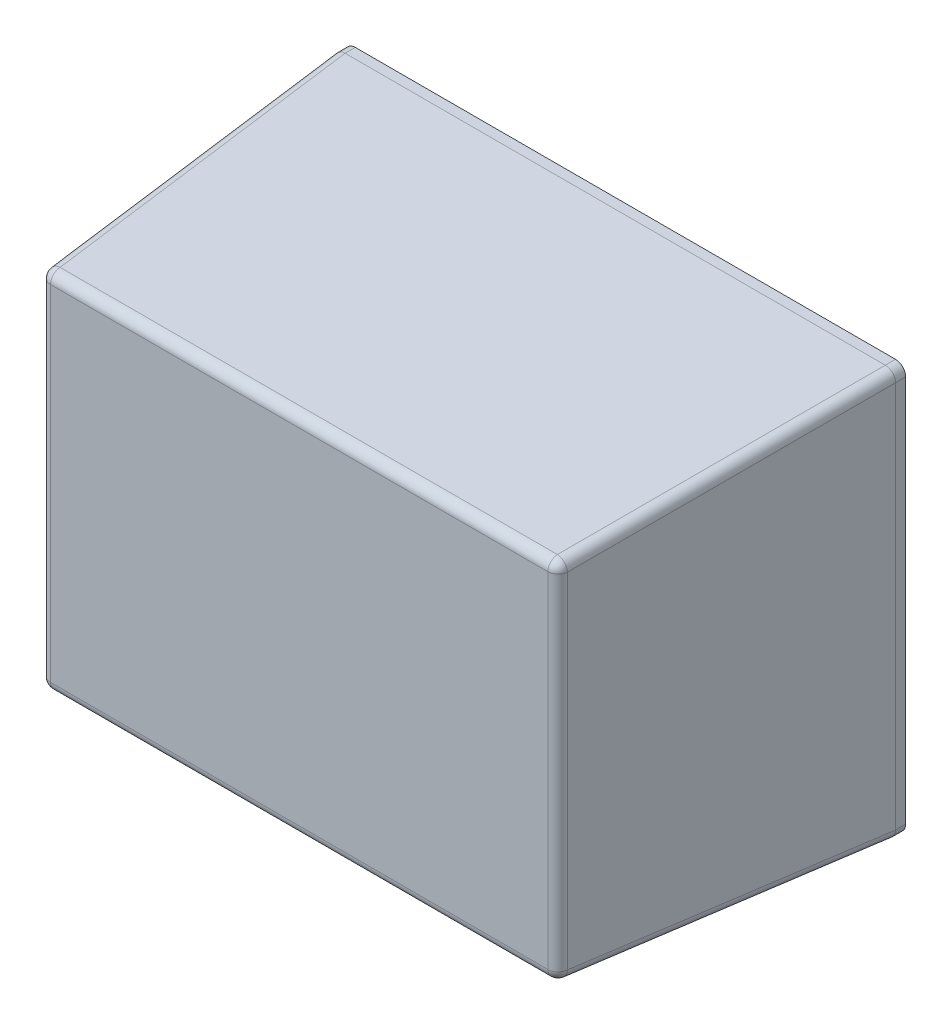
ISO-10303-21;
HEADER;
FILE_DESCRIPTION(('STEP AP214'),'2;1');
FILE_NAME('part.step','',(''),(''),'','','');
FILE_SCHEMA(('AUTOMOTIVE_DESIGN { 1 0 10303 214 1 1 1 1 }'));
ENDSEC;
DATA;
#1=APPLICATION_CONTEXT('core data for automotive mechanical design processes');
#2=APPLICATION_PROTOCOL_DEFINITION('international standard','automotive_design',2000,#1);
#3=PRODUCT_CONTEXT('',#1,'mechanical');
#4=PRODUCT('Part','Part','',(#3));
#5=PRODUCT_RELATED_PRODUCT_CATEGORY('part','',(#4));
#6=PRODUCT_DEFINITION_FORMATION('','',#4);
#7=PRODUCT_DEFINITION_CONTEXT('part definition',#1,'design');
#8=PRODUCT_DEFINITION('design','',#6,#7);
#9=PRODUCT_DEFINITION_SHAPE('','',#8);
#10=(LENGTH_UNIT() NAMED_UNIT(*) SI_UNIT(.MILLI.,.METRE.));
#11=(NAMED_UNIT(*) PLANE_ANGLE_UNIT() SI_UNIT($,.RADIAN.));
#12=(NAMED_UNIT(*) SI_UNIT($,.STERADIAN.) SOLID_ANGLE_UNIT());
#13=UNCERTAINTY_MEASURE_WITH_UNIT(LENGTH_MEASURE(1.E-05),#10,'distance_accuracy_value','');
#14=(GEOMETRIC_REPRESENTATION_CONTEXT(3) GLOBAL_UNCERTAINTY_ASSIGNED_CONTEXT((#13)) GLOBAL_UNIT_ASSIGNED_CONTEXT((#10,
#11,#12)) REPRESENTATION_CONTEXT('',''));
#15=CARTESIAN_POINT('',(0.,0.,0.));
#16=DIRECTION('',(0.,0.,1.));
#17=DIRECTION('',(1.,0.,0.));
#18=AXIS2_PLACEMENT_3D('',#15,#16,#17);
#19=CARTESIAN_POINT('',(-0.55,-0.380048718995,0.28));
#20=DIRECTION('',(-1.,0.,0.));
#21=DIRECTION('',(0.,0.,1.));
#22=AXIS2_PLACEMENT_3D('',#19,#20,#21);
#23=PLANE('',#22);
#24=DIRECTION('',(0.,-1.,0.));
#25=VECTOR('',#24,1.);
#26=CARTESIAN_POINT('',(-0.55,-0.347785001125,0.28));
#27=LINE('',#26,#25);
#28=CARTESIAN_POINT('',(-0.55,0.380048718995,0.28));
#29=VERTEX_POINT('',#28);
#30=CARTESIAN_POINT('',(-0.55,-0.380048718995,0.28));
#31=VERTEX_POINT('',#30);
#32=EDGE_CURVE('E42',#29,#31,#27,.T.);
#33=ORIENTED_EDGE('',*,*,#32,.F.);
#34=DIRECTION('',(0.,0.,-1.));
#35=VECTOR('',#34,1.);
#36=CARTESIAN_POINT('',(-0.55,0.380048718995,0.28));
#37=LINE('',#36,#35);
#38=CARTESIAN_POINT('',(-0.55,0.380048718995,0.26));
#39=VERTEX_POINT('',#38);
#40=EDGE_CURVE('E11',#29,#39,#37,.T.);
#41=ORIENTED_EDGE('',*,*,#40,.T.);
#42=DIRECTION('',(0.,1.,0.));
#43=VECTOR('',#42,1.);
#44=CARTESIAN_POINT('',(-0.55,0.380048718995,0.26));
#45=LINE('',#44,#43);
#46=CARTESIAN_POINT('',(-0.55,-0.380048718995,0.26));
#47=VERTEX_POINT('',#46);
#48=EDGE_CURVE('E228',#47,#39,#45,.T.);
#49=ORIENTED_EDGE('',*,*,#48,.F.);
#50=DIRECTION('',(0.,0.,-1.));
#51=VECTOR('',#50,1.);
#52=CARTESIAN_POINT('',(-0.55,-0.380048718995,0.28));
#53=LINE('',#52,#51);
#54=EDGE_CURVE('E204',#31,#47,#53,.T.);
#55=ORIENTED_EDGE('',*,*,#54,.F.);
#56=EDGE_LOOP('',(#33,#41,#49,#55));
#57=FACE_BOUND('',#56,.T.);
#58=ADVANCED_FACE('F16',(#57),#23,.T.);
#59=CARTESIAN_POINT('',(-0.530048718995,-0.4,0.28));
#60=CARTESIAN_POINT('',(-0.55,-0.4,0.28));
#61=CARTESIAN_POINT('',(-0.55,-0.380048718995,0.28));
#62=CARTESIAN_POINT('',(-0.530048718995,-0.4,0.26));
#63=CARTESIAN_POINT('',(-0.55,-0.4,0.26));
#64=CARTESIAN_POINT('',(-0.55,-0.380048718995,0.26));
#65=(BOUNDED_SURFACE() B_SPLINE_SURFACE(1,2,((#59,#60,#61),(#62,#63,#64)),.UNSPECIFIED.,.F.,.F.,
.F.) B_SPLINE_SURFACE_WITH_KNOTS((2,2),(3,3),(0.,0.995145815784),(2.358627482608,
3.924557824571),.UNSPECIFIED.) GEOMETRIC_REPRESENTATION_ITEM() RATIONAL_B_SPLINE_SURFACE(((1.,
0.708825072084,1.),(1.,0.708825072084,1.))) REPRESENTATION_ITEM('') SURFACE());
#66=CARTESIAN_POINT('',(-0.529951162038,-0.379951162038,0.28));
#67=DIRECTION('',(0.,0.,-1.));
#68=DIRECTION('',(-0.707106781186548,-0.707106781186548,0.));
#69=AXIS2_PLACEMENT_3D('',#66,#67,#68);
#70=ELLIPSE('',#69,0.02009755724517,0.02);
#71=CARTESIAN_POINT('',(-0.530048718995,-0.4,0.28));
#72=VERTEX_POINT('',#71);
#73=EDGE_CURVE('E29',#72,#31,#70,.T.);
#74=CARTESIAN_POINT('',(-0.529951162038,-0.379951162038,0.26));
#75=DIRECTION('',(0.,0.,-1.));
#76=DIRECTION('',(0.707106781186548,0.707106781186548,0.));
#77=AXIS2_PLACEMENT_3D('',#74,#75,#76);
#78=ELLIPSE('',#77,0.02009755724517,0.02);
#79=CARTESIAN_POINT('',(-0.530048718995,-0.4,0.26));
#80=VERTEX_POINT('',#79);
#81=EDGE_CURVE('E216',#80,#47,#78,.T.);
#82=DIRECTION('',(0.,0.,-1.));
#83=VECTOR('',#82,1.);
#84=CARTESIAN_POINT('',(-0.530048718995,-0.4,0.28));
#85=LINE('',#84,#83);
#86=EDGE_CURVE('E283',#72,#80,#85,.T.);
#87=ORIENTED_EDGE('',*,*,#73,.T.);
#88=ORIENTED_EDGE('',*,*,#54,.T.);
#89=ORIENTED_EDGE('',*,*,#81,.F.);
#90=ORIENTED_EDGE('',*,*,#86,.F.);
#91=EDGE_LOOP('',(#87,#88,#89,#90));
#92=FACE_BOUND('',#91,.T.);
#93=ADVANCED_FACE('F568',(#92),#65,.F.);
#94=CARTESIAN_POINT('',(0.530048718995,-0.4,0.28));
#95=DIRECTION('',(0.,-1.,0.));
#96=DIRECTION('',(0.,0.,-1.));
#97=AXIS2_PLACEMENT_3D('',#94,#95,#96);
#98=PLANE('',#97);
#99=DIRECTION('',(1.,0.,0.));
#100=VECTOR('',#99,1.);
#101=CARTESIAN_POINT('',(-0.4,-0.4,0.28));
#102=LINE('',#101,#100);
#103=CARTESIAN_POINT('',(0.530048718995,-0.4,0.28));
#104=VERTEX_POINT('',#103);
#105=EDGE_CURVE('E271',#72,#104,#102,.T.);
#106=ORIENTED_EDGE('',*,*,#105,.F.);
#107=ORIENTED_EDGE('',*,*,#86,.T.);
#108=DIRECTION('',(-1.,0.,0.));
#109=VECTOR('',#108,1.);
#110=CARTESIAN_POINT('',(-0.530048718995,-0.4,0.26));
#111=LINE('',#110,#109);
#112=CARTESIAN_POINT('',(0.530048718995,-0.4,0.26));
#113=VERTEX_POINT('',#112);
#114=EDGE_CURVE('E211',#113,#80,#111,.T.);
#115=ORIENTED_EDGE('',*,*,#114,.F.);
#116=DIRECTION('',(0.,0.,-1.));
#117=VECTOR('',#116,1.);
#118=CARTESIAN_POINT('',(0.530048718995,-0.4,0.28));
#119=LINE('',#118,#117);
#120=EDGE_CURVE('E284',#104,#113,#119,.T.);
#121=ORIENTED_EDGE('',*,*,#120,.F.);
#122=EDGE_LOOP('',(#106,#107,#115,#121));
#123=FACE_BOUND('',#122,.T.);
#124=ADVANCED_FACE('F572',(#123),#98,.T.);
#125=CARTESIAN_POINT('',(0.55,-0.380048718995,0.28));
#126=CARTESIAN_POINT('',(0.55,-0.4,0.28));
#127=CARTESIAN_POINT('',(0.530048718995,-0.4,0.28));
#128=CARTESIAN_POINT('',(0.55,-0.380048718995,0.26));
#129=CARTESIAN_POINT('',(0.55,-0.4,0.26));
#130=CARTESIAN_POINT('',(0.530048718995,-0.4,0.26));
#131=(BOUNDED_SURFACE() B_SPLINE_SURFACE(1,2,((#125,#126,#127),(#128,#129,#130)),.UNSPECIFIED.,
.F.,.F.,.F.) B_SPLINE_SURFACE_WITH_KNOTS((2,2),(3,3),(0.,0.995145815784),(2.358627482608,
3.924557824571),.UNSPECIFIED.) GEOMETRIC_REPRESENTATION_ITEM() RATIONAL_B_SPLINE_SURFACE(((1.,
0.708825072084,1.),(1.,0.708825072084,1.))) REPRESENTATION_ITEM('') SURFACE());
#132=CARTESIAN_POINT('',(0.529951162038,-0.379951162038,0.28));
#133=DIRECTION('',(0.,0.,-1.));
#134=DIRECTION('',(0.707106781186548,-0.707106781186548,0.));
#135=AXIS2_PLACEMENT_3D('',#132,#133,#134);
#136=ELLIPSE('',#135,0.02009755724517,0.02);
#137=CARTESIAN_POINT('',(0.55,-0.380048718995,0.28));
#138=VERTEX_POINT('',#137);
#139=EDGE_CURVE('E279',#138,#104,#136,.T.);
#140=CARTESIAN_POINT('',(0.529951162038,-0.379951162038,0.26));
#141=DIRECTION('',(0.,0.,-1.));
#142=DIRECTION('',(-0.707106781186548,0.707106781186548,0.));
#143=AXIS2_PLACEMENT_3D('',#140,#141,#142);
#144=ELLIPSE('',#143,0.02009755724517,0.02);
#145=CARTESIAN_POINT('',(0.55,-0.380048718995,0.26));
#146=VERTEX_POINT('',#145);
#147=EDGE_CURVE('E215',#146,#113,#144,.T.);
#148=DIRECTION('',(0.,0.,-1.));
#149=VECTOR('',#148,1.);
#150=CARTESIAN_POINT('',(0.55,-0.380048718995,0.28));
#151=LINE('',#150,#149);
#152=EDGE_CURVE('E301',#138,#146,#151,.T.);
#153=ORIENTED_EDGE('',*,*,#139,.T.);
#154=ORIENTED_EDGE('',*,*,#120,.T.);
#155=ORIENTED_EDGE('',*,*,#147,.F.);
#156=ORIENTED_EDGE('',*,*,#152,.F.);
#157=EDGE_LOOP('',(#153,#154,#155,#156));
#158=FACE_BOUND('',#157,.T.);
#159=ADVANCED_FACE('F550',(#158),#131,.F.);
#160=CARTESIAN_POINT('',(0.55,0.380048718995,0.28));
#161=DIRECTION('',(1.,0.,0.));
#162=DIRECTION('',(0.,1.,0.));
#163=AXIS2_PLACEMENT_3D('',#160,#161,#162);
#164=PLANE('',#163);
#165=DIRECTION('',(0.,1.,0.));
#166=VECTOR('',#165,1.);
#167=CARTESIAN_POINT('',(0.55,0.347785001125,0.28));
#168=LINE('',#167,#166);
#169=CARTESIAN_POINT('',(0.55,0.380048718995,0.28));
#170=VERTEX_POINT('',#169);
#171=EDGE_CURVE('E236',#138,#170,#168,.T.);
#172=ORIENTED_EDGE('',*,*,#171,.F.);
#173=ORIENTED_EDGE('',*,*,#152,.T.);
#174=DIRECTION('',(0.,-1.,0.));
#175=VECTOR('',#174,1.);
#176=CARTESIAN_POINT('',(0.55,-0.380048718995,0.26));
#177=LINE('',#176,#175);
#178=CARTESIAN_POINT('',(0.55,0.380048718995,0.26));
#179=VERTEX_POINT('',#178);
#180=EDGE_CURVE('E307',#179,#146,#177,.T.);
#181=ORIENTED_EDGE('',*,*,#180,.F.);
#182=DIRECTION('',(0.,0.,-1.));
#183=VECTOR('',#182,1.);
#184=CARTESIAN_POINT('',(0.55,0.380048718995,0.28));
#185=LINE('',#184,#183);
#186=EDGE_CURVE('E198',#170,#179,#185,.T.);
#187=ORIENTED_EDGE('',*,*,#186,.F.);
#188=EDGE_LOOP('',(#172,#173,#181,#187));
#189=FACE_BOUND('',#188,.T.);
#190=ADVANCED_FACE('F547',(#189),#164,.T.);
#191=CARTESIAN_POINT('',(0.530048718995,0.4,0.28));
#192=CARTESIAN_POINT('',(0.55,0.4,0.28));
#193=CARTESIAN_POINT('',(0.55,0.380048718995,0.28));
#194=CARTESIAN_POINT('',(0.530048718995,0.4,0.26));
#195=CARTESIAN_POINT('',(0.55,0.4,0.26));
#196=CARTESIAN_POINT('',(0.55,0.380048718995,0.26));
#197=(BOUNDED_SURFACE() B_SPLINE_SURFACE(1,2,((#191,#192,#193),(#194,#195,#196)),.UNSPECIFIED.,
.F.,.F.,.F.) B_SPLINE_SURFACE_WITH_KNOTS((2,2),(3,3),(0.,0.995145815784),(2.358627482608,
3.924557824571),.UNSPECIFIED.) GEOMETRIC_REPRESENTATION_ITEM() RATIONAL_B_SPLINE_SURFACE(((1.,
0.708825072084,1.),(1.,0.708825072084,1.))) REPRESENTATION_ITEM('') SURFACE());
#198=CARTESIAN_POINT('',(0.529951162038,0.379951162038,0.28));
#199=DIRECTION('',(0.,0.,-1.));
#200=DIRECTION('',(0.707106781186548,0.707106781186548,0.));
#201=AXIS2_PLACEMENT_3D('',#198,#199,#200);
#202=ELLIPSE('',#201,0.02009755724517,0.02);
#203=CARTESIAN_POINT('',(0.530048718995,0.4,0.28));
#204=VERTEX_POINT('',#203);
#205=EDGE_CURVE('E332',#204,#170,#202,.T.);
#206=CARTESIAN_POINT('',(0.529951162038,0.379951162038,0.26));
#207=DIRECTION('',(0.,0.,-1.));
#208=DIRECTION('',(-0.707106781186548,-0.707106781186548,0.));
#209=AXIS2_PLACEMENT_3D('',#206,#207,#208);
#210=ELLIPSE('',#209,0.02009755724517,0.02);
#211=CARTESIAN_POINT('',(0.530048718995,0.4,0.26));
#212=VERTEX_POINT('',#211);
#213=EDGE_CURVE('E210',#212,#179,#210,.T.);
#214=DIRECTION('',(0.,0.,-1.));
#215=VECTOR('',#214,1.);
#216=CARTESIAN_POINT('',(0.530048718995,0.4,0.28));
#217=LINE('',#216,#215);
#218=EDGE_CURVE('E259',#204,#212,#217,.T.);
#219=ORIENTED_EDGE('',*,*,#205,.T.);
#220=ORIENTED_EDGE('',*,*,#186,.T.);
#221=ORIENTED_EDGE('',*,*,#213,.F.);
#222=ORIENTED_EDGE('',*,*,#218,.F.);
#223=EDGE_LOOP('',(#219,#220,#221,#222));
#224=FACE_BOUND('',#223,.T.);
#225=ADVANCED_FACE('F18',(#224),#197,.F.);
#226=CARTESIAN_POINT('',(-0.530048718995,0.4,0.28));
#227=DIRECTION('',(0.,1.,0.));
#228=DIRECTION('',(1.,0.,0.));
#229=AXIS2_PLACEMENT_3D('',#226,#227,#228);
#230=PLANE('',#229);
#231=DIRECTION('',(-1.,0.,0.));
#232=VECTOR('',#231,1.);
#233=CARTESIAN_POINT('',(0.4,0.4,0.28));
#234=LINE('',#233,#232);
#235=CARTESIAN_POINT('',(-0.530048718995,0.4,0.28));
#236=VERTEX_POINT('',#235);
#237=EDGE_CURVE('E274',#204,#236,#234,.T.);
#238=ORIENTED_EDGE('',*,*,#237,.F.);
#239=ORIENTED_EDGE('',*,*,#218,.T.);
#240=DIRECTION('',(1.,0.,0.));
#241=VECTOR('',#240,1.);
#242=CARTESIAN_POINT('',(0.530048718995,0.4,0.26));
#243=LINE('',#242,#241);
#244=CARTESIAN_POINT('',(-0.530048718995,0.4,0.26));
#245=VERTEX_POINT('',#244);
#246=EDGE_CURVE('E205',#245,#212,#243,.T.);
#247=ORIENTED_EDGE('',*,*,#246,.F.);
#248=DIRECTION('',(0.,0.,-1.));
#249=VECTOR('',#248,1.);
#250=CARTESIAN_POINT('',(-0.530048718995,0.4,0.28));
#251=LINE('',#250,#249);
#252=EDGE_CURVE('E219',#236,#245,#251,.T.);
#253=ORIENTED_EDGE('',*,*,#252,.F.);
#254=EDGE_LOOP('',(#238,#239,#247,#253));
#255=FACE_BOUND('',#254,.T.);
#256=ADVANCED_FACE('F530',(#255),#230,.T.);
#257=CARTESIAN_POINT('',(-0.55,0.380048718995,0.28));
#258=CARTESIAN_POINT('',(-0.55,0.4,0.28));
#259=CARTESIAN_POINT('',(-0.530048718995,0.4,0.28));
#260=CARTESIAN_POINT('',(-0.55,0.380048718995,0.26));
#261=CARTESIAN_POINT('',(-0.55,0.4,0.26));
#262=CARTESIAN_POINT('',(-0.530048718995,0.4,0.26));
#263=(BOUNDED_SURFACE() B_SPLINE_SURFACE(1,2,((#257,#258,#259),(#260,#261,#262)),.UNSPECIFIED.,
.F.,.F.,.F.) B_SPLINE_SURFACE_WITH_KNOTS((2,2),(3,3),(0.,0.995145815784),(2.358627482608,
3.924557824571),.UNSPECIFIED.) GEOMETRIC_REPRESENTATION_ITEM() RATIONAL_B_SPLINE_SURFACE(((1.,
0.708825072084,1.),(1.,0.708825072084,1.))) REPRESENTATION_ITEM('') SURFACE());
#264=CARTESIAN_POINT('',(-0.529951162038,0.379951162038,0.28));
#265=DIRECTION('',(0.,0.,-1.));
#266=DIRECTION('',(-0.707106781186548,0.707106781186548,0.));
#267=AXIS2_PLACEMENT_3D('',#264,#265,#266);
#268=ELLIPSE('',#267,0.02009755724517,0.02);
#269=EDGE_CURVE('E263',#29,#236,#268,.T.);
#270=CARTESIAN_POINT('',(-0.529951162038,0.379951162038,0.26));
#271=DIRECTION('',(0.,0.,-1.));
#272=DIRECTION('',(0.707106781186548,-0.707106781186548,0.));
#273=AXIS2_PLACEMENT_3D('',#270,#271,#272);
#274=ELLIPSE('',#273,0.02009755724517,0.02);
#275=EDGE_CURVE('E209',#39,#245,#274,.T.);
#276=ORIENTED_EDGE('',*,*,#269,.T.);
#277=ORIENTED_EDGE('',*,*,#252,.T.);
#278=ORIENTED_EDGE('',*,*,#275,.F.);
#279=ORIENTED_EDGE('',*,*,#40,.F.);
#280=EDGE_LOOP('',(#276,#277,#278,#279));
#281=FACE_BOUND('',#280,.T.);
#282=ADVANCED_FACE('F532',(#281),#263,.F.);
#283=CARTESIAN_POINT('',(0.,0.,0.26));
#284=DIRECTION('',(0.,0.,1.));
#285=DIRECTION('',(1.,0.,0.));
#286=AXIS2_PLACEMENT_3D('',#283,#284,#285);
#287=PLANE('',#286);
#288=ORIENTED_EDGE('',*,*,#275,.T.);
#289=ORIENTED_EDGE('',*,*,#246,.T.);
#290=ORIENTED_EDGE('',*,*,#213,.T.);
#291=ORIENTED_EDGE('',*,*,#180,.T.);
#292=ORIENTED_EDGE('',*,*,#147,.T.);
#293=ORIENTED_EDGE('',*,*,#114,.T.);
#294=ORIENTED_EDGE('',*,*,#81,.T.);
#295=ORIENTED_EDGE('',*,*,#48,.T.);
#296=EDGE_LOOP('',(#288,#289,#290,#291,#292,#293,#294,#295));
#297=FACE_BOUND('',#296,.T.);
#298=ADVANCED_FACE('F526',(#297),#287,.F.);
#299=CARTESIAN_POINT('',(-0.2,-0.337995074872,0.88));
#300=DIRECTION('',(-1.,0.,0.));
#301=DIRECTION('',(0.,-0.681998360062852,0.731353701618841));
#302=AXIS2_PLACEMENT_3D('',#299,#300,#301);
#303=CYLINDRICAL_SURFACE('',#302,0.02);
#304=CARTESIAN_POINT('',(0.487995074872,-0.337995074872,0.88));
#305=DIRECTION('',(-1.,0.,0.));
#306=DIRECTION('',(0.,-0.997564050259826,0.0697564737441078));
#307=AXIS2_PLACEMENT_3D('',#304,#305,#306);
#308=CIRCLE('',#307,0.02);
#309=CARTESIAN_POINT('',(0.487995074872,-0.357946355877,0.881395129475));
#310=VERTEX_POINT('',#309);
#311=CARTESIAN_POINT('',(0.487995074872,-0.337995074872,0.9));
#312=VERTEX_POINT('',#311);
#313=EDGE_CURVE('E231',#310,#312,#308,.T.);
#314=ORIENTED_EDGE('',*,*,#313,.T.);
#315=DIRECTION('',(-1.,0.,0.));
#316=VECTOR('',#315,1.);
#317=CARTESIAN_POINT('',(-0.2,-0.337995074872,0.9));
#318=LINE('',#317,#316);
#319=CARTESIAN_POINT('',(-0.487995074872,-0.337995074872,0.9));
#320=VERTEX_POINT('',#319);
#321=EDGE_CURVE('E187',#312,#320,#318,.T.);
#322=ORIENTED_EDGE('',*,*,#321,.T.);
#323=CARTESIAN_POINT('',(-0.487995074872,-0.337995074872,0.88));
#324=DIRECTION('',(1.,0.,0.));
#325=DIRECTION('',(0.,0.,1.));
#326=AXIS2_PLACEMENT_3D('',#323,#324,#325);
#327=CIRCLE('',#326,0.02);
#328=CARTESIAN_POINT('',(-0.487995074872,-0.357946355877,0.881395129475));
#329=VERTEX_POINT('',#328);
#330=EDGE_CURVE('E240',#320,#329,#327,.T.);
#331=ORIENTED_EDGE('',*,*,#330,.T.);
#332=DIRECTION('',(1.,0.,0.));
#333=VECTOR('',#332,1.);
#334=CARTESIAN_POINT('',(-0.2,-0.357946355877,0.881395129475));
#335=LINE('',#334,#333);
#336=EDGE_CURVE('E255',#329,#310,#335,.T.);
#337=ORIENTED_EDGE('',*,*,#336,.T.);
#338=EDGE_LOOP('',(#314,#322,#331,#337));
#339=FACE_BOUND('',#338,.T.);
#340=ADVANCED_FACE('F359',(#339),#303,.T.);
#341=CARTESIAN_POINT('',(-0.487995074872,-0.173892500563,0.88));
#342=DIRECTION('',(0.,1.,0.));
#343=DIRECTION('',(-0.681998360062852,0.,0.731353701618841));
#344=AXIS2_PLACEMENT_3D('',#341,#342,#343);
#345=CYLINDRICAL_SURFACE('',#344,0.02);
#346=CARTESIAN_POINT('',(-0.487995074872,-0.337995074872,0.88));
#347=DIRECTION('',(0.,1.,0.));
#348=DIRECTION('',(-0.997564050259826,0.,0.0697564737441078));
#349=AXIS2_PLACEMENT_3D('',#346,#347,#348);
#350=CIRCLE('',#349,0.02);
#351=CARTESIAN_POINT('',(-0.507946355877,-0.337995074872,0.881395129475));
#352=VERTEX_POINT('',#351);
#353=EDGE_CURVE('E245',#352,#320,#350,.T.);
#354=ORIENTED_EDGE('',*,*,#353,.T.);
#355=DIRECTION('',(0.,1.,0.));
#356=VECTOR('',#355,1.);
#357=CARTESIAN_POINT('',(-0.487995074872,-0.173892500563,0.9));
#358=LINE('',#357,#356);
#359=CARTESIAN_POINT('',(-0.487995074872,0.337995074872,0.9));
#360=VERTEX_POINT('',#359);
#361=EDGE_CURVE('E241',#320,#360,#358,.T.);
#362=ORIENTED_EDGE('',*,*,#361,.T.);
#363=CARTESIAN_POINT('',(-0.487995074872,0.337995074872,0.88));
#364=DIRECTION('',(0.,-1.,0.));
#365=DIRECTION('',(0.,0.,1.));
#366=AXIS2_PLACEMENT_3D('',#363,#364,#365);
#367=CIRCLE('',#366,0.02);
#368=CARTESIAN_POINT('',(-0.507946355877,0.337995074872,0.881395129475));
#369=VERTEX_POINT('',#368);
#370=EDGE_CURVE('E246',#360,#369,#367,.T.);
#371=ORIENTED_EDGE('',*,*,#370,.T.);
#372=DIRECTION('',(0.,-1.,0.));
#373=VECTOR('',#372,1.);
#374=CARTESIAN_POINT('',(-0.507946355877,-0.173892500563,0.881395129475));
#375=LINE('',#374,#373);
#376=EDGE_CURVE('E250',#369,#352,#375,.T.);
#377=ORIENTED_EDGE('',*,*,#376,.T.);
#378=EDGE_LOOP('',(#354,#362,#371,#377));
#379=FACE_BOUND('',#378,.T.);
#380=ADVANCED_FACE('F610',(#379),#345,.T.);
#381=CARTESIAN_POINT('',(-0.487995074872,-0.337995074872,0.88));
#382=DIRECTION('',(0.362330205201988,-0.835112809389974,-0.413888170875987));
#383=DIRECTION('',(-0.550078717633075,-0.550078717633075,0.628352455883085));
#384=AXIS2_PLACEMENT_3D('',#381,#382,#383);
#385=SPHERICAL_SURFACE('',#384,0.02);
#386=ORIENTED_EDGE('',*,*,#353,.F.);
#387=CARTESIAN_POINT('',(-0.487995074872,-0.337995074872,0.88));
#388=DIRECTION('',(0.0695873743166583,0.0695873743166583,0.99514581578351));
#389=DIRECTION('',(-0.703674354609938,-0.703674354609938,0.0984114085285514));
#390=AXIS2_PLACEMENT_3D('',#387,#388,#389);
#391=CIRCLE('',#390,0.02);
#392=EDGE_CURVE('E140',#352,#329,#391,.T.);
#393=ORIENTED_EDGE('',*,*,#392,.T.);
#394=ORIENTED_EDGE('',*,*,#330,.F.);
#395=EDGE_LOOP('',(#386,#393,#394));
#396=FACE_BOUND('',#395,.T.);
#397=ADVANCED_FACE('F351',(#396),#385,.T.);
#398=CARTESIAN_POINT('',(0.2,0.337995074872,0.88));
#399=DIRECTION('',(1.,0.,0.));
#400=DIRECTION('',(0.,0.681998360062852,0.731353701618841));
#401=AXIS2_PLACEMENT_3D('',#398,#399,#400);
#402=CYLINDRICAL_SURFACE('',#401,0.02);
#403=CARTESIAN_POINT('',(-0.487995074872,0.337995074872,0.88));
#404=DIRECTION('',(1.,0.,0.));
#405=DIRECTION('',(0.,0.997564050259826,0.0697564737441078));
#406=AXIS2_PLACEMENT_3D('',#403,#404,#405);
#407=CIRCLE('',#406,0.02);
#408=CARTESIAN_POINT('',(-0.487995074872,0.357946355877,0.881395129475));
#409=VERTEX_POINT('',#408);
#410=EDGE_CURVE('E179',#409,#360,#407,.T.);
#411=ORIENTED_EDGE('',*,*,#410,.T.);
#412=DIRECTION('',(1.,0.,0.));
#413=VECTOR('',#412,1.);
#414=CARTESIAN_POINT('',(0.2,0.337995074872,0.9));
#415=LINE('',#414,#413);
#416=CARTESIAN_POINT('',(0.487995074872,0.337995074872,0.9));
#417=VERTEX_POINT('',#416);
#418=EDGE_CURVE('E172',#360,#417,#415,.T.);
#419=ORIENTED_EDGE('',*,*,#418,.T.);
#420=CARTESIAN_POINT('',(0.487995074872,0.337995074872,0.88));
#421=DIRECTION('',(-1.,0.,0.));
#422=DIRECTION('',(0.,0.,1.));
#423=AXIS2_PLACEMENT_3D('',#420,#421,#422);
#424=CIRCLE('',#423,0.02);
#425=CARTESIAN_POINT('',(0.487995074872,0.357946355877,0.881395129475));
#426=VERTEX_POINT('',#425);
#427=EDGE_CURVE('E163',#417,#426,#424,.T.);
#428=ORIENTED_EDGE('',*,*,#427,.T.);
#429=DIRECTION('',(-1.,0.,0.));
#430=VECTOR('',#429,1.);
#431=CARTESIAN_POINT('',(0.2,0.357946355877,0.881395129475));
#432=LINE('',#431,#430);
#433=EDGE_CURVE('E173',#426,#409,#432,.T.);
#434=ORIENTED_EDGE('',*,*,#433,.T.);
#435=EDGE_LOOP('',(#411,#419,#428,#434));
#436=FACE_BOUND('',#435,.T.);
#437=ADVANCED_FACE('F177',(#436),#402,.T.);
#438=CARTESIAN_POINT('',(-0.487995074872,0.337995074872,0.88));
#439=DIRECTION('',(-0.362330205201988,-0.835112809389974,0.413888170875987));
#440=DIRECTION('',(-0.550078717633075,0.550078717633075,0.628352455883085));
#441=AXIS2_PLACEMENT_3D('',#438,#439,#440);
#442=SPHERICAL_SURFACE('',#441,0.02);
#443=ORIENTED_EDGE('',*,*,#410,.F.);
#444=CARTESIAN_POINT('',(-0.487995074872,0.337995074872,0.88));
#445=DIRECTION('',(0.0695873743166583,-0.0695873743166583,0.99514581578351));
#446=DIRECTION('',(-0.703674354609938,0.703674354609938,0.0984114085285514));
#447=AXIS2_PLACEMENT_3D('',#444,#445,#446);
#448=CIRCLE('',#447,0.02);
#449=EDGE_CURVE('E160',#409,#369,#448,.T.);
#450=ORIENTED_EDGE('',*,*,#449,.T.);
#451=ORIENTED_EDGE('',*,*,#370,.F.);
#452=EDGE_LOOP('',(#443,#450,#451));
#453=FACE_BOUND('',#452,.T.);
#454=ADVANCED_FACE('F600',(#453),#442,.T.);
#455=CARTESIAN_POINT('',(0.487995074872,0.173892500563,0.88));
#456=DIRECTION('',(0.,-1.,0.));
#457=DIRECTION('',(0.681998360062852,0.,0.731353701618841));
#458=AXIS2_PLACEMENT_3D('',#455,#456,#457);
#459=CYLINDRICAL_SURFACE('',#458,0.02);
#460=CARTESIAN_POINT('',(0.487995074872,0.337995074872,0.88));
#461=DIRECTION('',(0.,-1.,0.));
#462=DIRECTION('',(0.997564050259826,0.,0.0697564737441078));
#463=AXIS2_PLACEMENT_3D('',#460,#461,#462);
#464=CIRCLE('',#463,0.02);
#465=CARTESIAN_POINT('',(0.507946355877,0.337995074872,0.881395129475));
#466=VERTEX_POINT('',#465);
#467=EDGE_CURVE('E148',#466,#417,#464,.T.);
#468=ORIENTED_EDGE('',*,*,#467,.T.);
#469=DIRECTION('',(0.,-1.,0.));
#470=VECTOR('',#469,1.);
#471=CARTESIAN_POINT('',(0.487995074872,0.173892500563,0.9));
#472=LINE('',#471,#470);
#473=EDGE_CURVE('E153',#417,#312,#472,.T.);
#474=ORIENTED_EDGE('',*,*,#473,.T.);
#475=CARTESIAN_POINT('',(0.487995074872,-0.337995074872,0.88));
#476=DIRECTION('',(0.,1.,0.));
#477=DIRECTION('',(0.,0.,1.));
#478=AXIS2_PLACEMENT_3D('',#475,#476,#477);
#479=CIRCLE('',#478,0.02);
#480=CARTESIAN_POINT('',(0.507946355877,-0.337995074872,0.881395129475));
#481=VERTEX_POINT('',#480);
#482=EDGE_CURVE('E190',#312,#481,#479,.T.);
#483=ORIENTED_EDGE('',*,*,#482,.T.);
#484=DIRECTION('',(0.,1.,0.));
#485=VECTOR('',#484,1.);
#486=CARTESIAN_POINT('',(0.507946355877,0.173892500563,0.881395129475));
#487=LINE('',#486,#485);
#488=EDGE_CURVE('E156',#481,#466,#487,.T.);
#489=ORIENTED_EDGE('',*,*,#488,.T.);
#490=EDGE_LOOP('',(#468,#474,#483,#489));
#491=FACE_BOUND('',#490,.T.);
#492=ADVANCED_FACE('F150',(#491),#459,.T.);
#493=CARTESIAN_POINT('',(0.487995074872,0.337995074872,0.88));
#494=DIRECTION('',(0.362330205201988,-0.835112809389974,0.413888170875987));
#495=DIRECTION('',(0.550078717633075,0.550078717633075,0.628352455883085));
#496=AXIS2_PLACEMENT_3D('',#493,#494,#495);
#497=SPHERICAL_SURFACE('',#496,0.02);
#498=ORIENTED_EDGE('',*,*,#467,.F.);
#499=CARTESIAN_POINT('',(0.487995074872,0.337995074872,0.88));
#500=DIRECTION('',(-0.0695873743166583,-0.0695873743166583,0.99514581578351));
#501=DIRECTION('',(0.703674354609938,0.703674354609938,0.0984114085285514));
#502=AXIS2_PLACEMENT_3D('',#499,#500,#501);
#503=CIRCLE('',#502,0.02);
#504=EDGE_CURVE('E166',#466,#426,#503,.T.);
#505=ORIENTED_EDGE('',*,*,#504,.T.);
#506=ORIENTED_EDGE('',*,*,#427,.F.);
#507=EDGE_LOOP('',(#498,#505,#506));
#508=FACE_BOUND('',#507,.T.);
#509=ADVANCED_FACE('F165',(#508),#497,.T.);
#510=CARTESIAN_POINT('',(0.487995074872,-0.337995074872,0.88));
#511=DIRECTION('',(-0.362330205201988,-0.835112809389974,-0.413888170875987));
#512=DIRECTION('',(0.550078717633075,-0.550078717633075,0.628352455883085));
#513=AXIS2_PLACEMENT_3D('',#510,#511,#512);
#514=SPHERICAL_SURFACE('',#513,0.02);
#515=ORIENTED_EDGE('',*,*,#313,.F.);
#516=CARTESIAN_POINT('',(0.487995074872,-0.337995074872,0.88));
#517=DIRECTION('',(-0.0695873743166583,0.0695873743166583,0.99514581578351));
#518=DIRECTION('',(0.703674354609938,-0.703674354609938,0.0984114085285514));
#519=AXIS2_PLACEMENT_3D('',#516,#517,#518);
#520=CIRCLE('',#519,0.02);
#521=EDGE_CURVE('E221',#310,#481,#520,.T.);
#522=ORIENTED_EDGE('',*,*,#521,.T.);
#523=ORIENTED_EDGE('',*,*,#482,.F.);
#524=EDGE_LOOP('',(#515,#522,#523));
#525=FACE_BOUND('',#524,.T.);
#526=ADVANCED_FACE('F555',(#525),#514,.T.);
#527=CARTESIAN_POINT('',(-0.504462310394,0.354462310394,0.644507560631));
#528=DIRECTION('',(-0.0695873743166583,0.0695873743166583,-0.99514581578351));
#529=DIRECTION('',(-0.703674354609938,0.703674354609938,0.0984114085285513));
#530=AXIS2_PLACEMENT_3D('',#527,#528,#529);
#531=CYLINDRICAL_SURFACE('',#530,0.02);
#532=ORIENTED_EDGE('',*,*,#449,.F.);
#533=DIRECTION('',(-0.069587374316626,0.069587374316626,-0.995145815783514));
#534=VECTOR('',#533,1.);
#535=CARTESIAN_POINT('',(-0.504462310394,0.374413591399,0.645902690106));
#536=LINE('',#535,#534);
#537=EDGE_CURVE('E225',#409,#236,#536,.T.);
#538=ORIENTED_EDGE('',*,*,#537,.T.);
#539=ORIENTED_EDGE('',*,*,#269,.F.);
#540=DIRECTION('',(0.069587374316626,-0.069587374316626,0.995145815783514));
#541=VECTOR('',#540,1.);
#542=CARTESIAN_POINT('',(-0.524413591399,0.354462310394,0.645902690106));
#543=LINE('',#542,#541);
#544=EDGE_CURVE('E277',#29,#369,#543,.T.);
#545=ORIENTED_EDGE('',*,*,#544,.T.);
#546=EDGE_LOOP('',(#532,#538,#539,#545));
#547=FACE_BOUND('',#546,.T.);
#548=ADVANCED_FACE('F537',(#547),#531,.T.);
#549=CARTESIAN_POINT('',(0.4,0.378322688298,0.59));
#550=DIRECTION('',(0.,0.997564050259825,0.0697564737441177));
#551=DIRECTION('',(1.,0.,0.));
#552=AXIS2_PLACEMENT_3D('',#549,#550,#551);
#553=PLANE('',#552);
#554=ORIENTED_EDGE('',*,*,#433,.F.);
#555=DIRECTION('',(-0.069587374316626,-0.069587374316626,0.995145815783514));
#556=VECTOR('',#555,1.);
#557=CARTESIAN_POINT('',(0.508083386476,0.378034667481,0.594118889571));
#558=LINE('',#557,#556);
#559=EDGE_CURVE('E296',#204,#426,#558,.T.);
#560=ORIENTED_EDGE('',*,*,#559,.F.);
#561=ORIENTED_EDGE('',*,*,#237,.T.);
#562=ORIENTED_EDGE('',*,*,#537,.F.);
#563=EDGE_LOOP('',(#554,#560,#561,#562));
#564=FACE_BOUND('',#563,.T.);
#565=ADVANCED_FACE('F539',(#564),#553,.T.);
#566=CARTESIAN_POINT('',(0.508083386476,0.358083386476,0.592723760096));
#567=DIRECTION('',(0.0695873743166583,0.0695873743166583,-0.99514581578351));
#568=DIRECTION('',(0.703674354609938,0.703674354609938,0.0984114085285513));
#569=AXIS2_PLACEMENT_3D('',#566,#567,#568);
#570=CYLINDRICAL_SURFACE('',#569,0.02);
#571=ORIENTED_EDGE('',*,*,#504,.F.);
#572=DIRECTION('',(0.069587374316626,0.069587374316626,-0.995145815783514));
#573=VECTOR('',#572,1.);
#574=CARTESIAN_POINT('',(0.528034667481,0.358083386476,0.594118889571));
#575=LINE('',#574,#573);
#576=EDGE_CURVE('E278',#466,#170,#575,.T.);
#577=ORIENTED_EDGE('',*,*,#576,.T.);
#578=ORIENTED_EDGE('',*,*,#205,.F.);
#579=ORIENTED_EDGE('',*,*,#559,.T.);
#580=EDGE_LOOP('',(#571,#577,#578,#579));
#581=FACE_BOUND('',#580,.T.);
#582=ADVANCED_FACE('F542',(#581),#570,.T.);
#583=CARTESIAN_POINT('',(0.528322688298,0.347785001125,0.59));
#584=DIRECTION('',(0.997564050259825,0.,0.0697564737441177));
#585=DIRECTION('',(0.,-1.,0.));
#586=AXIS2_PLACEMENT_3D('',#583,#584,#585);
#587=PLANE('',#586);
#588=ORIENTED_EDGE('',*,*,#488,.F.);
#589=DIRECTION('',(-0.069587374316626,0.069587374316626,0.995145815783514));
#590=VECTOR('',#589,1.);
#591=CARTESIAN_POINT('',(0.524413591399,-0.354462310394,0.645902690106));
#592=LINE('',#591,#590);
#593=EDGE_CURVE('E237',#138,#481,#592,.T.);
#594=ORIENTED_EDGE('',*,*,#593,.F.);
#595=ORIENTED_EDGE('',*,*,#171,.T.);
#596=ORIENTED_EDGE('',*,*,#576,.F.);
#597=EDGE_LOOP('',(#588,#594,#595,#596));
#598=FACE_BOUND('',#597,.T.);
#599=ADVANCED_FACE('F544',(#598),#587,.T.);
#600=CARTESIAN_POINT('',(0.,0.,0.9));
#601=DIRECTION('',(0.,0.,1.));
#602=DIRECTION('',(1.,0.,0.));
#603=AXIS2_PLACEMENT_3D('',#600,#601,#602);
#604=PLANE('',#603);
#605=ORIENTED_EDGE('',*,*,#321,.F.);
#606=ORIENTED_EDGE('',*,*,#473,.F.);
#607=ORIENTED_EDGE('',*,*,#418,.F.);
#608=ORIENTED_EDGE('',*,*,#361,.F.);
#609=EDGE_LOOP('',(#605,#606,#607,#608));
#610=FACE_BOUND('',#609,.T.);
#611=ADVANCED_FACE('F185',(#610),#604,.T.);
#612=CARTESIAN_POINT('',(0.504462310394,-0.354462310394,0.644507560631));
#613=DIRECTION('',(-0.0695873743166583,0.0695873743166583,0.99514581578351));
#614=DIRECTION('',(0.703674354609938,-0.703674354609938,0.0984114085285513));
#615=AXIS2_PLACEMENT_3D('',#612,#613,#614);
#616=CYLINDRICAL_SURFACE('',#615,0.02);
#617=ORIENTED_EDGE('',*,*,#521,.F.);
#618=DIRECTION('',(0.069587374316626,-0.069587374316626,-0.995145815783514));
#619=VECTOR('',#618,1.);
#620=CARTESIAN_POINT('',(0.504462310394,-0.374413591399,0.645902690106));
#621=LINE('',#620,#619);
#622=EDGE_CURVE('E232',#310,#104,#621,.T.);
#623=ORIENTED_EDGE('',*,*,#622,.T.);
#624=ORIENTED_EDGE('',*,*,#139,.F.);
#625=ORIENTED_EDGE('',*,*,#593,.T.);
#626=EDGE_LOOP('',(#617,#623,#624,#625));
#627=FACE_BOUND('',#626,.T.);
#628=ADVANCED_FACE('F552',(#627),#616,.T.);
#629=CARTESIAN_POINT('',(-0.528322688298,-0.347785001125,0.59));
#630=DIRECTION('',(-0.997564050259825,0.,0.0697564737441177));
#631=DIRECTION('',(0.,1.,0.));
#632=AXIS2_PLACEMENT_3D('',#629,#630,#631);
#633=PLANE('',#632);
#634=ORIENTED_EDGE('',*,*,#376,.F.);
#635=ORIENTED_EDGE('',*,*,#544,.F.);
#636=ORIENTED_EDGE('',*,*,#32,.T.);
#637=DIRECTION('',(-0.069587374316626,-0.069587374316626,-0.995145815783514));
#638=VECTOR('',#637,1.);
#639=CARTESIAN_POINT('',(-0.528034667481,-0.358083386476,0.594118889571));
#640=LINE('',#639,#638);
#641=EDGE_CURVE('E256',#352,#31,#640,.T.);
#642=ORIENTED_EDGE('',*,*,#641,.F.);
#643=EDGE_LOOP('',(#634,#635,#636,#642));
#644=FACE_BOUND('',#643,.T.);
#645=ADVANCED_FACE('F592',(#644),#633,.T.);
#646=CARTESIAN_POINT('',(-0.508083386476,-0.358083386476,0.592723760096));
#647=DIRECTION('',(0.0695873743166583,0.0695873743166583,0.99514581578351));
#648=DIRECTION('',(-0.703674354609938,-0.703674354609938,0.0984114085285513));
#649=AXIS2_PLACEMENT_3D('',#646,#647,#648);
#650=CYLINDRICAL_SURFACE('',#649,0.02);
#651=ORIENTED_EDGE('',*,*,#392,.F.);
#652=ORIENTED_EDGE('',*,*,#641,.T.);
#653=ORIENTED_EDGE('',*,*,#73,.F.);
#654=DIRECTION('',(0.069587374316626,0.069587374316626,0.995145815783514));
#655=VECTOR('',#654,1.);
#656=CARTESIAN_POINT('',(-0.508083386476,-0.378034667481,0.594118889571));
#657=LINE('',#656,#655);
#658=EDGE_CURVE('E22',#72,#329,#657,.T.);
#659=ORIENTED_EDGE('',*,*,#658,.T.);
#660=EDGE_LOOP('',(#651,#652,#653,#659));
#661=FACE_BOUND('',#660,.T.);
#662=ADVANCED_FACE('F361',(#661),#650,.T.);
#663=CARTESIAN_POINT('',(-0.4,-0.378322688298,0.59));
#664=DIRECTION('',(0.,-0.997564050259825,0.0697564737441177));
#665=DIRECTION('',(-1.,0.,0.));
#666=AXIS2_PLACEMENT_3D('',#663,#664,#665);
#667=PLANE('',#666);
#668=ORIENTED_EDGE('',*,*,#336,.F.);
#669=ORIENTED_EDGE('',*,*,#658,.F.);
#670=ORIENTED_EDGE('',*,*,#105,.T.);
#671=ORIENTED_EDGE('',*,*,#622,.F.);
#672=EDGE_LOOP('',(#668,#669,#670,#671));
#673=FACE_BOUND('',#672,.T.);
#674=ADVANCED_FACE('F356',(#673),#667,.T.);
#675=CLOSED_SHELL('',(#58,#93,#124,#159,#190,#225,#256,#282,#298,#340,#380,#397,#437,#454,#492,
#509,#526,#548,#565,#582,#599,#611,#628,#645,#662,#674));
#676=MANIFOLD_SOLID_BREP('B1',#675);
#677=ADVANCED_BREP_SHAPE_REPRESENTATION('',(#18,#676),#14);
#678=SHAPE_DEFINITION_REPRESENTATION(#9,#677);
ENDSEC;
END-ISO-10303-21;
